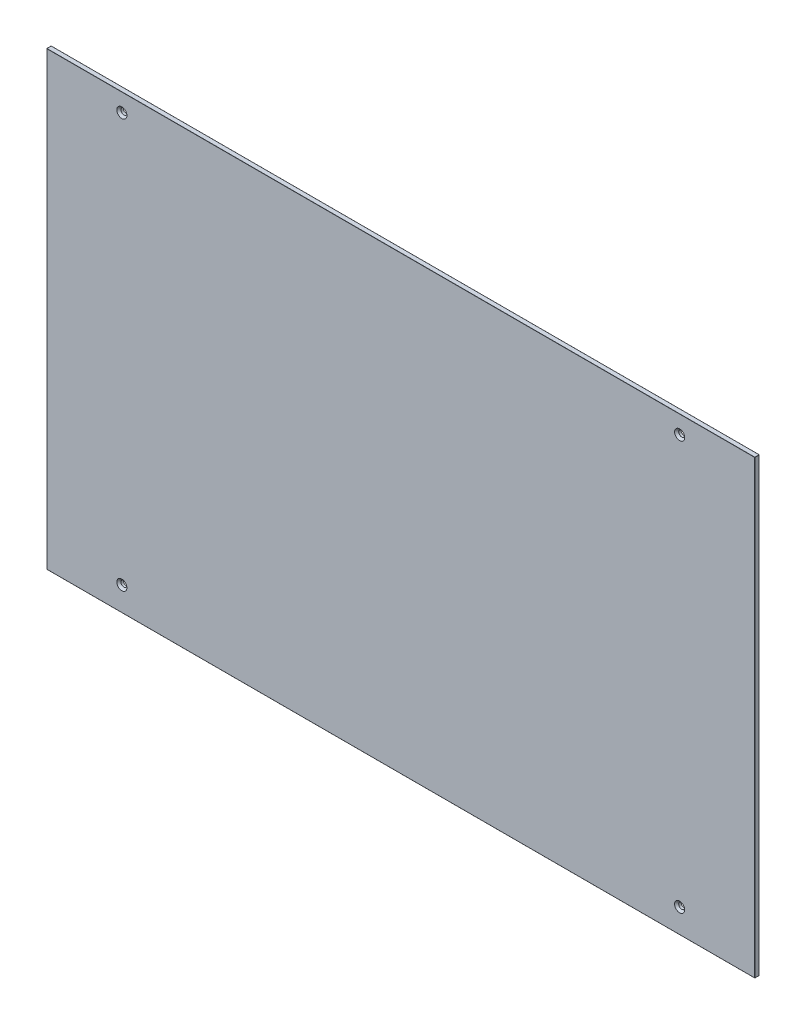
ISO-10303-21;
HEADER;
FILE_DESCRIPTION(('STEP AP214'),'2;1');
FILE_NAME('part.step','',(''),(''),'','','');
FILE_SCHEMA(('AUTOMOTIVE_DESIGN { 1 0 10303 214 1 1 1 1 }'));
ENDSEC;
DATA;
#1=APPLICATION_CONTEXT('core data for automotive mechanical design processes');
#2=APPLICATION_PROTOCOL_DEFINITION('international standard','automotive_design',2000,#1);
#3=PRODUCT_CONTEXT('',#1,'mechanical');
#4=PRODUCT('Part','Part','',(#3));
#5=PRODUCT_RELATED_PRODUCT_CATEGORY('part','',(#4));
#6=PRODUCT_DEFINITION_FORMATION('','',#4);
#7=PRODUCT_DEFINITION_CONTEXT('part definition',#1,'design');
#8=PRODUCT_DEFINITION('design','',#6,#7);
#9=PRODUCT_DEFINITION_SHAPE('','',#8);
#10=(LENGTH_UNIT() NAMED_UNIT(*) SI_UNIT(.MILLI.,.METRE.));
#11=(NAMED_UNIT(*) PLANE_ANGLE_UNIT() SI_UNIT($,.RADIAN.));
#12=(NAMED_UNIT(*) SI_UNIT($,.STERADIAN.) SOLID_ANGLE_UNIT());
#13=UNCERTAINTY_MEASURE_WITH_UNIT(LENGTH_MEASURE(1.E-05),#10,'distance_accuracy_value','');
#14=(GEOMETRIC_REPRESENTATION_CONTEXT(3) GLOBAL_UNCERTAINTY_ASSIGNED_CONTEXT((#13)) GLOBAL_UNIT_ASSIGNED_CONTEXT((#10,
#11,#12)) REPRESENTATION_CONTEXT('',''));
#15=CARTESIAN_POINT('',(0.,0.,0.));
#16=DIRECTION('',(0.,0.,1.));
#17=DIRECTION('',(1.,0.,0.));
#18=AXIS2_PLACEMENT_3D('',#15,#16,#17);
#19=CARTESIAN_POINT('',(471.,-300.,6.));
#20=DIRECTION('',(-1.,0.,0.));
#21=DIRECTION('',(0.,0.,1.));
#22=AXIS2_PLACEMENT_3D('',#19,#20,#21);
#23=PLANE('',#22);
#24=DIRECTION('',(0.,0.,-1.));
#25=VECTOR('',#24,1.);
#26=CARTESIAN_POINT('',(471.,-299.8,6.));
#27=LINE('',#26,#25);
#28=CARTESIAN_POINT('',(471.,-299.8,5.8));
#29=VERTEX_POINT('',#28);
#30=CARTESIAN_POINT('',(471.,-299.8,0.2));
#31=VERTEX_POINT('',#30);
#32=EDGE_CURVE('E180',#29,#31,#27,.T.);
#33=ORIENTED_EDGE('',*,*,#32,.T.);
#34=DIRECTION('',(0.,1.,0.));
#35=VECTOR('',#34,1.);
#36=CARTESIAN_POINT('',(471.,300.,0.2));
#37=LINE('',#36,#35);
#38=CARTESIAN_POINT('',(471.,299.8,0.2));
#39=VERTEX_POINT('',#38);
#40=EDGE_CURVE('E182',#31,#39,#37,.T.);
#41=ORIENTED_EDGE('',*,*,#40,.T.);
#42=DIRECTION('',(0.,0.,-1.));
#43=VECTOR('',#42,1.);
#44=CARTESIAN_POINT('',(471.,299.8,6.));
#45=LINE('',#44,#43);
#46=CARTESIAN_POINT('',(471.,299.8,5.8));
#47=VERTEX_POINT('',#46);
#48=EDGE_CURVE('E176',#39,#47,#45,.F.);
#49=ORIENTED_EDGE('',*,*,#48,.T.);
#50=DIRECTION('',(0.,1.,0.));
#51=VECTOR('',#50,1.);
#52=CARTESIAN_POINT('',(471.,-300.,5.8));
#53=LINE('',#52,#51);
#54=EDGE_CURVE('E178',#47,#29,#53,.F.);
#55=ORIENTED_EDGE('',*,*,#54,.T.);
#56=EDGE_LOOP('',(#33,#41,#49,#55));
#57=FACE_BOUND('',#56,.T.);
#58=ADVANCED_FACE('F32',(#57),#23,.F.);
#59=CARTESIAN_POINT('',(-471.,300.,6.));
#60=DIRECTION('',(0.,-1.,0.));
#61=DIRECTION('',(0.,0.,-1.));
#62=AXIS2_PLACEMENT_3D('',#59,#60,#61);
#63=PLANE('',#62);
#64=DIRECTION('',(-1.,0.,0.));
#65=VECTOR('',#64,1.);
#66=CARTESIAN_POINT('',(-471.,300.,5.8));
#67=LINE('',#66,#65);
#68=CARTESIAN_POINT('',(-470.8,300.,5.8));
#69=VERTEX_POINT('',#68);
#70=CARTESIAN_POINT('',(470.8,300.,5.8));
#71=VERTEX_POINT('',#70);
#72=EDGE_CURVE('E194',#69,#71,#67,.F.);
#73=ORIENTED_EDGE('',*,*,#72,.T.);
#74=DIRECTION('',(0.,0.,-1.));
#75=VECTOR('',#74,1.);
#76=CARTESIAN_POINT('',(470.8,300.,6.));
#77=LINE('',#76,#75);
#78=CARTESIAN_POINT('',(470.8,300.,0.2));
#79=VERTEX_POINT('',#78);
#80=EDGE_CURVE('E198',#71,#79,#77,.T.);
#81=ORIENTED_EDGE('',*,*,#80,.T.);
#82=DIRECTION('',(-1.,0.,0.));
#83=VECTOR('',#82,1.);
#84=CARTESIAN_POINT('',(-471.,300.,0.2));
#85=LINE('',#84,#83);
#86=CARTESIAN_POINT('',(-470.8,300.,0.2));
#87=VERTEX_POINT('',#86);
#88=EDGE_CURVE('E196',#79,#87,#85,.T.);
#89=ORIENTED_EDGE('',*,*,#88,.T.);
#90=DIRECTION('',(0.,0.,-1.));
#91=VECTOR('',#90,1.);
#92=CARTESIAN_POINT('',(-470.8,300.,6.));
#93=LINE('',#92,#91);
#94=EDGE_CURVE('E192',#87,#69,#93,.F.);
#95=ORIENTED_EDGE('',*,*,#94,.T.);
#96=EDGE_LOOP('',(#73,#81,#89,#95));
#97=FACE_BOUND('',#96,.T.);
#98=ADVANCED_FACE('F317',(#97),#63,.F.);
#99=CARTESIAN_POINT('',(-471.,-300.,6.));
#100=DIRECTION('',(1.,0.,0.));
#101=DIRECTION('',(0.,0.,-1.));
#102=AXIS2_PLACEMENT_3D('',#99,#100,#101);
#103=PLANE('',#102);
#104=DIRECTION('',(0.,-1.,0.));
#105=VECTOR('',#104,1.);
#106=CARTESIAN_POINT('',(-471.,-300.,0.2));
#107=LINE('',#106,#105);
#108=CARTESIAN_POINT('',(-471.,299.8,0.2));
#109=VERTEX_POINT('',#108);
#110=CARTESIAN_POINT('',(-471.,-299.8,0.2));
#111=VERTEX_POINT('',#110);
#112=EDGE_CURVE('E41',#109,#111,#107,.T.);
#113=ORIENTED_EDGE('',*,*,#112,.T.);
#114=DIRECTION('',(0.,0.,-1.));
#115=VECTOR('',#114,1.);
#116=CARTESIAN_POINT('',(-471.,-299.8,6.));
#117=LINE('',#116,#115);
#118=CARTESIAN_POINT('',(-471.,-299.8,5.8));
#119=VERTEX_POINT('',#118);
#120=EDGE_CURVE('E11',#111,#119,#117,.F.);
#121=ORIENTED_EDGE('',*,*,#120,.T.);
#122=DIRECTION('',(0.,-1.,0.));
#123=VECTOR('',#122,1.);
#124=CARTESIAN_POINT('',(-471.,-300.,5.8));
#125=LINE('',#124,#123);
#126=CARTESIAN_POINT('',(-471.,299.8,5.8));
#127=VERTEX_POINT('',#126);
#128=EDGE_CURVE('E201',#119,#127,#125,.F.);
#129=ORIENTED_EDGE('',*,*,#128,.T.);
#130=DIRECTION('',(0.,0.,-1.));
#131=VECTOR('',#130,1.);
#132=CARTESIAN_POINT('',(-471.,299.8,6.));
#133=LINE('',#132,#131);
#134=EDGE_CURVE('E52',#127,#109,#133,.T.);
#135=ORIENTED_EDGE('',*,*,#134,.T.);
#136=EDGE_LOOP('',(#113,#121,#129,#135));
#137=FACE_BOUND('',#136,.T.);
#138=ADVANCED_FACE('F323',(#137),#103,.F.);
#139=CARTESIAN_POINT('',(-471.,-300.,6.));
#140=DIRECTION('',(0.,1.,0.));
#141=DIRECTION('',(0.,0.,1.));
#142=AXIS2_PLACEMENT_3D('',#139,#140,#141);
#143=PLANE('',#142);
#144=DIRECTION('',(0.,0.,-1.));
#145=VECTOR('',#144,1.);
#146=CARTESIAN_POINT('',(-470.8,-300.,6.));
#147=LINE('',#146,#145);
#148=CARTESIAN_POINT('',(-470.8,-300.,5.8));
#149=VERTEX_POINT('',#148);
#150=CARTESIAN_POINT('',(-470.8,-300.,0.2));
#151=VERTEX_POINT('',#150);
#152=EDGE_CURVE('E125',#149,#151,#147,.T.);
#153=ORIENTED_EDGE('',*,*,#152,.T.);
#154=DIRECTION('',(1.,0.,0.));
#155=VECTOR('',#154,1.);
#156=CARTESIAN_POINT('',(471.,-300.,0.2));
#157=LINE('',#156,#155);
#158=CARTESIAN_POINT('',(470.8,-300.,0.2));
#159=VERTEX_POINT('',#158);
#160=EDGE_CURVE('E165',#151,#159,#157,.T.);
#161=ORIENTED_EDGE('',*,*,#160,.T.);
#162=DIRECTION('',(0.,0.,-1.));
#163=VECTOR('',#162,1.);
#164=CARTESIAN_POINT('',(470.8,-300.,6.));
#165=LINE('',#164,#163);
#166=CARTESIAN_POINT('',(470.8,-300.,5.8));
#167=VERTEX_POINT('',#166);
#168=EDGE_CURVE('E128',#159,#167,#165,.F.);
#169=ORIENTED_EDGE('',*,*,#168,.T.);
#170=DIRECTION('',(1.,0.,0.));
#171=VECTOR('',#170,1.);
#172=CARTESIAN_POINT('',(-471.,-300.,5.8));
#173=LINE('',#172,#171);
#174=EDGE_CURVE('E120',#167,#149,#173,.F.);
#175=ORIENTED_EDGE('',*,*,#174,.T.);
#176=EDGE_LOOP('',(#153,#161,#169,#175));
#177=FACE_BOUND('',#176,.T.);
#178=ADVANCED_FACE('F122',(#177),#143,.F.);
#179=CARTESIAN_POINT('',(0.,0.,6.));
#180=DIRECTION('',(0.,0.,-1.));
#181=DIRECTION('',(-1.,0.,0.));
#182=AXIS2_PLACEMENT_3D('',#179,#180,#181);
#183=PLANE('',#182);
#184=DIRECTION('',(0.,-1.,0.));
#185=VECTOR('',#184,1.);
#186=CARTESIAN_POINT('',(-470.8,0.,6.));
#187=LINE('',#186,#185);
#188=CARTESIAN_POINT('',(-470.8,299.8,6.));
#189=VERTEX_POINT('',#188);
#190=CARTESIAN_POINT('',(-470.8,-299.8,6.));
#191=VERTEX_POINT('',#190);
#192=EDGE_CURVE('E185',#189,#191,#187,.T.);
#193=ORIENTED_EDGE('',*,*,#192,.T.);
#194=DIRECTION('',(1.,0.,0.));
#195=VECTOR('',#194,1.);
#196=CARTESIAN_POINT('',(0.,-299.8,6.));
#197=LINE('',#196,#195);
#198=CARTESIAN_POINT('',(470.8,-299.8,6.));
#199=VERTEX_POINT('',#198);
#200=EDGE_CURVE('E139',#191,#199,#197,.T.);
#201=ORIENTED_EDGE('',*,*,#200,.T.);
#202=DIRECTION('',(0.,1.,0.));
#203=VECTOR('',#202,1.);
#204=CARTESIAN_POINT('',(470.8,0.,6.));
#205=LINE('',#204,#203);
#206=CARTESIAN_POINT('',(470.8,299.8,6.));
#207=VERTEX_POINT('',#206);
#208=EDGE_CURVE('E189',#199,#207,#205,.T.);
#209=ORIENTED_EDGE('',*,*,#208,.T.);
#210=DIRECTION('',(-1.,0.,0.));
#211=VECTOR('',#210,1.);
#212=CARTESIAN_POINT('',(0.,299.8,6.));
#213=LINE('',#212,#211);
#214=EDGE_CURVE('E187',#207,#189,#213,.T.);
#215=ORIENTED_EDGE('',*,*,#214,.T.);
#216=EDGE_LOOP('',(#193,#201,#209,#215));
#217=FACE_BOUND('',#216,.T.);
#218=CARTESIAN_POINT('',(-371.,-268.,6.));
#219=DIRECTION('',(0.,0.,-1.));
#220=DIRECTION('',(-1.,0.,0.));
#221=AXIS2_PLACEMENT_3D('',#218,#219,#220);
#222=CIRCLE('',#221,6.75000000000014);
#223=CARTESIAN_POINT('',(-377.75,-268.,6.));
#224=VERTEX_POINT('',#223);
#225=EDGE_CURVE('E289',#224,#224,#222,.T.);
#226=ORIENTED_EDGE('',*,*,#225,.T.);
#227=EDGE_LOOP('',(#226));
#228=FACE_BOUND('',#227,.T.);
#229=CARTESIAN_POINT('',(371.,-268.,6.));
#230=DIRECTION('',(0.,0.,-1.));
#231=DIRECTION('',(-1.,0.,0.));
#232=AXIS2_PLACEMENT_3D('',#229,#230,#231);
#233=CIRCLE('',#232,6.75000000000014);
#234=CARTESIAN_POINT('',(364.25,-268.,6.));
#235=VERTEX_POINT('',#234);
#236=EDGE_CURVE('E286',#235,#235,#233,.T.);
#237=ORIENTED_EDGE('',*,*,#236,.T.);
#238=EDGE_LOOP('',(#237));
#239=FACE_BOUND('',#238,.T.);
#240=CARTESIAN_POINT('',(371.,276.,6.));
#241=DIRECTION('',(0.,0.,-1.));
#242=DIRECTION('',(-1.,0.,0.));
#243=AXIS2_PLACEMENT_3D('',#240,#241,#242);
#244=CIRCLE('',#243,6.75000000000014);
#245=CARTESIAN_POINT('',(364.25,276.,6.));
#246=VERTEX_POINT('',#245);
#247=EDGE_CURVE('E283',#246,#246,#244,.T.);
#248=ORIENTED_EDGE('',*,*,#247,.T.);
#249=EDGE_LOOP('',(#248));
#250=FACE_BOUND('',#249,.T.);
#251=CARTESIAN_POINT('',(-371.,276.,6.));
#252=DIRECTION('',(0.,0.,-1.));
#253=DIRECTION('',(-1.,0.,0.));
#254=AXIS2_PLACEMENT_3D('',#251,#252,#253);
#255=CIRCLE('',#254,6.75000000000014);
#256=CARTESIAN_POINT('',(-377.75,276.,6.));
#257=VERTEX_POINT('',#256);
#258=EDGE_CURVE('E280',#257,#257,#255,.T.);
#259=ORIENTED_EDGE('',*,*,#258,.T.);
#260=EDGE_LOOP('',(#259));
#261=FACE_BOUND('',#260,.T.);
#262=ADVANCED_FACE('F342',(#217,#228,#239,#250,#261),#183,.F.);
#263=CARTESIAN_POINT('',(0.,0.,0.));
#264=DIRECTION('',(0.,0.,-1.));
#265=DIRECTION('',(-1.,0.,0.));
#266=AXIS2_PLACEMENT_3D('',#263,#264,#265);
#267=PLANE('',#266);
#268=DIRECTION('',(0.,1.,0.));
#269=VECTOR('',#268,1.);
#270=CARTESIAN_POINT('',(470.8,-300.,0.));
#271=LINE('',#270,#269);
#272=CARTESIAN_POINT('',(470.8,299.8,0.));
#273=VERTEX_POINT('',#272);
#274=CARTESIAN_POINT('',(470.8,-299.8,0.));
#275=VERTEX_POINT('',#274);
#276=EDGE_CURVE('E171',#273,#275,#271,.F.);
#277=ORIENTED_EDGE('',*,*,#276,.T.);
#278=DIRECTION('',(1.,0.,0.));
#279=VECTOR('',#278,1.);
#280=CARTESIAN_POINT('',(-471.,-299.8,0.));
#281=LINE('',#280,#279);
#282=CARTESIAN_POINT('',(-470.8,-299.8,0.));
#283=VERTEX_POINT('',#282);
#284=EDGE_CURVE('E173',#275,#283,#281,.F.);
#285=ORIENTED_EDGE('',*,*,#284,.T.);
#286=DIRECTION('',(0.,-1.,0.));
#287=VECTOR('',#286,1.);
#288=CARTESIAN_POINT('',(-470.8,300.,0.));
#289=LINE('',#288,#287);
#290=CARTESIAN_POINT('',(-470.8,299.8,0.));
#291=VERTEX_POINT('',#290);
#292=EDGE_CURVE('E167',#283,#291,#289,.F.);
#293=ORIENTED_EDGE('',*,*,#292,.T.);
#294=DIRECTION('',(-1.,0.,0.));
#295=VECTOR('',#294,1.);
#296=CARTESIAN_POINT('',(471.,299.8,0.));
#297=LINE('',#296,#295);
#298=EDGE_CURVE('E169',#291,#273,#297,.F.);
#299=ORIENTED_EDGE('',*,*,#298,.T.);
#300=EDGE_LOOP('',(#277,#285,#293,#299));
#301=FACE_BOUND('',#300,.T.);
#302=CARTESIAN_POINT('',(-371.,-268.,0.));
#303=DIRECTION('',(0.,0.,1.));
#304=DIRECTION('',(1.,0.,0.));
#305=AXIS2_PLACEMENT_3D('',#302,#303,#304);
#306=CIRCLE('',#305,3.99999999999999);
#307=CARTESIAN_POINT('',(-367.,-268.,0.));
#308=VERTEX_POINT('',#307);
#309=EDGE_CURVE('E258',#308,#308,#306,.T.);
#310=ORIENTED_EDGE('',*,*,#309,.T.);
#311=EDGE_LOOP('',(#310));
#312=FACE_BOUND('',#311,.T.);
#313=CARTESIAN_POINT('',(371.,-268.,0.));
#314=DIRECTION('',(0.,0.,1.));
#315=DIRECTION('',(1.,0.,0.));
#316=AXIS2_PLACEMENT_3D('',#313,#314,#315);
#317=CIRCLE('',#316,3.99999999999999);
#318=CARTESIAN_POINT('',(375.,-268.,0.));
#319=VERTEX_POINT('',#318);
#320=EDGE_CURVE('E264',#319,#319,#317,.T.);
#321=ORIENTED_EDGE('',*,*,#320,.T.);
#322=EDGE_LOOP('',(#321));
#323=FACE_BOUND('',#322,.T.);
#324=CARTESIAN_POINT('',(371.,276.,0.));
#325=DIRECTION('',(0.,0.,1.));
#326=DIRECTION('',(1.,0.,0.));
#327=AXIS2_PLACEMENT_3D('',#324,#325,#326);
#328=CIRCLE('',#327,3.99999999999999);
#329=CARTESIAN_POINT('',(375.,276.,0.));
#330=VERTEX_POINT('',#329);
#331=EDGE_CURVE('E269',#330,#330,#328,.T.);
#332=ORIENTED_EDGE('',*,*,#331,.T.);
#333=EDGE_LOOP('',(#332));
#334=FACE_BOUND('',#333,.T.);
#335=CARTESIAN_POINT('',(-371.,276.,0.));
#336=DIRECTION('',(0.,0.,1.));
#337=DIRECTION('',(1.,0.,0.));
#338=AXIS2_PLACEMENT_3D('',#335,#336,#337);
#339=CIRCLE('',#338,3.99999999999999);
#340=CARTESIAN_POINT('',(-367.,276.,0.));
#341=VERTEX_POINT('',#340);
#342=EDGE_CURVE('E274',#341,#341,#339,.T.);
#343=ORIENTED_EDGE('',*,*,#342,.T.);
#344=EDGE_LOOP('',(#343));
#345=FACE_BOUND('',#344,.T.);
#346=ADVANCED_FACE('F345',(#301,#312,#323,#334,#345),#267,.T.);
#347=CARTESIAN_POINT('',(-371.,276.,0.));
#348=DIRECTION('',(0.,0.,1.));
#349=DIRECTION('',(1.,0.,0.));
#350=AXIS2_PLACEMENT_3D('',#347,#348,#349);
#351=CYLINDRICAL_SURFACE('',#350,3.99999999999999);
#352=CARTESIAN_POINT('',(-371.,276.,3.24999999999983));
#353=DIRECTION('',(0.,0.,-1.));
#354=DIRECTION('',(-1.,0.,0.));
#355=AXIS2_PLACEMENT_3D('',#352,#353,#354);
#356=CIRCLE('',#355,3.99999999999999);
#357=CARTESIAN_POINT('',(-375.,276.,3.24999999999983));
#358=VERTEX_POINT('',#357);
#359=EDGE_CURVE('E157',#358,#358,#356,.F.);
#360=ORIENTED_EDGE('',*,*,#359,.T.);
#361=EDGE_LOOP('',(#360));
#362=FACE_BOUND('',#361,.T.);
#363=ORIENTED_EDGE('',*,*,#342,.F.);
#364=EDGE_LOOP('',(#363));
#365=FACE_BOUND('',#364,.T.);
#366=ADVANCED_FACE('F355',(#362,#365),#351,.F.);
#367=CARTESIAN_POINT('',(371.,276.,0.));
#368=DIRECTION('',(0.,0.,1.));
#369=DIRECTION('',(1.,0.,0.));
#370=AXIS2_PLACEMENT_3D('',#367,#368,#369);
#371=CYLINDRICAL_SURFACE('',#370,3.99999999999999);
#372=CARTESIAN_POINT('',(371.,276.,3.24999999999983));
#373=DIRECTION('',(0.,0.,-1.));
#374=DIRECTION('',(-1.,0.,0.));
#375=AXIS2_PLACEMENT_3D('',#372,#373,#374);
#376=CIRCLE('',#375,3.99999999999999);
#377=CARTESIAN_POINT('',(367.,276.,3.24999999999983));
#378=VERTEX_POINT('',#377);
#379=EDGE_CURVE('E160',#378,#378,#376,.F.);
#380=ORIENTED_EDGE('',*,*,#379,.T.);
#381=EDGE_LOOP('',(#380));
#382=FACE_BOUND('',#381,.T.);
#383=ORIENTED_EDGE('',*,*,#331,.F.);
#384=EDGE_LOOP('',(#383));
#385=FACE_BOUND('',#384,.T.);
#386=ADVANCED_FACE('F297',(#382,#385),#371,.F.);
#387=CARTESIAN_POINT('',(371.,-268.,0.));
#388=DIRECTION('',(0.,0.,1.));
#389=DIRECTION('',(1.,0.,0.));
#390=AXIS2_PLACEMENT_3D('',#387,#388,#389);
#391=CYLINDRICAL_SURFACE('',#390,3.99999999999999);
#392=CARTESIAN_POINT('',(371.,-268.,3.24999999999983));
#393=DIRECTION('',(0.,0.,-1.));
#394=DIRECTION('',(-1.,0.,0.));
#395=AXIS2_PLACEMENT_3D('',#392,#393,#394);
#396=CIRCLE('',#395,3.99999999999999);
#397=CARTESIAN_POINT('',(367.,-268.,3.24999999999983));
#398=VERTEX_POINT('',#397);
#399=EDGE_CURVE('E292',#398,#398,#396,.F.);
#400=ORIENTED_EDGE('',*,*,#399,.T.);
#401=EDGE_LOOP('',(#400));
#402=FACE_BOUND('',#401,.T.);
#403=ORIENTED_EDGE('',*,*,#320,.F.);
#404=EDGE_LOOP('',(#403));
#405=FACE_BOUND('',#404,.T.);
#406=ADVANCED_FACE('F334',(#402,#405),#391,.F.);
#407=CARTESIAN_POINT('',(-371.,-268.,0.));
#408=DIRECTION('',(0.,0.,1.));
#409=DIRECTION('',(1.,0.,0.));
#410=AXIS2_PLACEMENT_3D('',#407,#408,#409);
#411=CYLINDRICAL_SURFACE('',#410,3.99999999999999);
#412=CARTESIAN_POINT('',(-371.,-268.,3.24999999999983));
#413=DIRECTION('',(0.,0.,-1.));
#414=DIRECTION('',(-1.,0.,0.));
#415=AXIS2_PLACEMENT_3D('',#412,#413,#414);
#416=CIRCLE('',#415,3.99999999999999);
#417=CARTESIAN_POINT('',(-375.,-268.,3.24999999999983));
#418=VERTEX_POINT('',#417);
#419=EDGE_CURVE('E277',#418,#418,#416,.F.);
#420=ORIENTED_EDGE('',*,*,#419,.T.);
#421=EDGE_LOOP('',(#420));
#422=FACE_BOUND('',#421,.T.);
#423=ORIENTED_EDGE('',*,*,#309,.F.);
#424=EDGE_LOOP('',(#423));
#425=FACE_BOUND('',#424,.T.);
#426=ADVANCED_FACE('F329',(#422,#425),#411,.F.);
#427=CARTESIAN_POINT('',(-371.,-268.,3.24999999999983));
#428=DIRECTION('',(0.,0.,1.));
#429=DIRECTION('',(1.,0.,0.));
#430=AXIS2_PLACEMENT_3D('',#427,#428,#429);
#431=CONICAL_SURFACE('',#430,3.99999999999999,0.785398163397446);
#432=ORIENTED_EDGE('',*,*,#225,.F.);
#433=EDGE_LOOP('',(#432));
#434=FACE_BOUND('',#433,.T.);
#435=ORIENTED_EDGE('',*,*,#419,.F.);
#436=EDGE_LOOP('',(#435));
#437=FACE_BOUND('',#436,.T.);
#438=ADVANCED_FACE('F312',(#434,#437),#431,.F.);
#439=CARTESIAN_POINT('',(371.,-268.,3.24999999999983));
#440=DIRECTION('',(0.,0.,1.));
#441=DIRECTION('',(1.,0.,0.));
#442=AXIS2_PLACEMENT_3D('',#439,#440,#441);
#443=CONICAL_SURFACE('',#442,3.99999999999999,0.785398163397446);
#444=ORIENTED_EDGE('',*,*,#236,.F.);
#445=EDGE_LOOP('',(#444));
#446=FACE_BOUND('',#445,.T.);
#447=ORIENTED_EDGE('',*,*,#399,.F.);
#448=EDGE_LOOP('',(#447));
#449=FACE_BOUND('',#448,.T.);
#450=ADVANCED_FACE('F303',(#446,#449),#443,.F.);
#451=CARTESIAN_POINT('',(371.,276.,3.24999999999983));
#452=DIRECTION('',(0.,0.,1.));
#453=DIRECTION('',(1.,0.,0.));
#454=AXIS2_PLACEMENT_3D('',#451,#452,#453);
#455=CONICAL_SURFACE('',#454,3.99999999999999,0.785398163397446);
#456=ORIENTED_EDGE('',*,*,#247,.F.);
#457=EDGE_LOOP('',(#456));
#458=FACE_BOUND('',#457,.T.);
#459=ORIENTED_EDGE('',*,*,#379,.F.);
#460=EDGE_LOOP('',(#459));
#461=FACE_BOUND('',#460,.T.);
#462=ADVANCED_FACE('F300',(#458,#461),#455,.F.);
#463=CARTESIAN_POINT('',(-371.,276.,3.24999999999983));
#464=DIRECTION('',(0.,0.,1.));
#465=DIRECTION('',(1.,0.,0.));
#466=AXIS2_PLACEMENT_3D('',#463,#464,#465);
#467=CONICAL_SURFACE('',#466,3.99999999999999,0.785398163397446);
#468=ORIENTED_EDGE('',*,*,#258,.F.);
#469=EDGE_LOOP('',(#468));
#470=FACE_BOUND('',#469,.T.);
#471=ORIENTED_EDGE('',*,*,#359,.F.);
#472=EDGE_LOOP('',(#471));
#473=FACE_BOUND('',#472,.T.);
#474=ADVANCED_FACE('F302',(#470,#473),#467,.F.);
#475=CARTESIAN_POINT('',(0.,299.8,5.8));
#476=DIRECTION('',(-1.,0.,0.));
#477=DIRECTION('',(0.,0.,1.));
#478=AXIS2_PLACEMENT_3D('',#475,#476,#477);
#479=CYLINDRICAL_SURFACE('',#478,0.2);
#480=CARTESIAN_POINT('',(-470.8,299.8,5.8));
#481=DIRECTION('',(-1.,0.,0.));
#482=DIRECTION('',(0.,0.,1.));
#483=AXIS2_PLACEMENT_3D('',#480,#481,#482);
#484=CIRCLE('',#483,0.2);
#485=EDGE_CURVE('E36',#189,#69,#484,.T.);
#486=ORIENTED_EDGE('',*,*,#485,.F.);
#487=ORIENTED_EDGE('',*,*,#214,.F.);
#488=CARTESIAN_POINT('',(470.8,299.8,5.8));
#489=DIRECTION('',(1.,0.,0.));
#490=DIRECTION('',(0.,0.,-1.));
#491=AXIS2_PLACEMENT_3D('',#488,#489,#490);
#492=CIRCLE('',#491,0.2);
#493=EDGE_CURVE('E251',#71,#207,#492,.T.);
#494=ORIENTED_EDGE('',*,*,#493,.F.);
#495=ORIENTED_EDGE('',*,*,#72,.F.);
#496=EDGE_LOOP('',(#486,#487,#494,#495));
#497=FACE_BOUND('',#496,.T.);
#498=ADVANCED_FACE('F34',(#497),#479,.T.);
#499=CARTESIAN_POINT('',(-470.8,299.8,5.8));
#500=DIRECTION('',(0.,0.,1.));
#501=DIRECTION('',(1.,0.,0.));
#502=AXIS2_PLACEMENT_3D('',#499,#500,#501);
#503=SPHERICAL_SURFACE('',#502,0.2);
#504=CARTESIAN_POINT('',(-470.8,299.8,5.8));
#505=DIRECTION('',(0.,1.,0.));
#506=DIRECTION('',(0.,0.,1.));
#507=AXIS2_PLACEMENT_3D('',#504,#505,#506);
#508=CIRCLE('',#507,0.2);
#509=EDGE_CURVE('E246',#189,#127,#508,.F.);
#510=ORIENTED_EDGE('',*,*,#509,.F.);
#511=ORIENTED_EDGE('',*,*,#485,.T.);
#512=CARTESIAN_POINT('',(-470.8,299.8,5.8));
#513=DIRECTION('',(0.,0.,1.));
#514=DIRECTION('',(1.,0.,0.));
#515=AXIS2_PLACEMENT_3D('',#512,#513,#514);
#516=CIRCLE('',#515,0.2);
#517=EDGE_CURVE('E249',#127,#69,#516,.F.);
#518=ORIENTED_EDGE('',*,*,#517,.F.);
#519=EDGE_LOOP('',(#510,#511,#518));
#520=FACE_BOUND('',#519,.T.);
#521=ADVANCED_FACE('F395',(#520),#503,.T.);
#522=CARTESIAN_POINT('',(470.8,299.8,5.8));
#523=DIRECTION('',(0.,0.,1.));
#524=DIRECTION('',(1.,0.,0.));
#525=AXIS2_PLACEMENT_3D('',#522,#523,#524);
#526=SPHERICAL_SURFACE('',#525,0.2);
#527=CARTESIAN_POINT('',(470.8,299.8,5.8));
#528=DIRECTION('',(0.,0.,1.));
#529=DIRECTION('',(1.,0.,0.));
#530=AXIS2_PLACEMENT_3D('',#527,#528,#529);
#531=CIRCLE('',#530,0.2);
#532=EDGE_CURVE('E240',#71,#47,#531,.F.);
#533=ORIENTED_EDGE('',*,*,#532,.F.);
#534=ORIENTED_EDGE('',*,*,#493,.T.);
#535=CARTESIAN_POINT('',(470.8,299.8,5.8));
#536=DIRECTION('',(0.,1.,0.));
#537=DIRECTION('',(0.,0.,1.));
#538=AXIS2_PLACEMENT_3D('',#535,#536,#537);
#539=CIRCLE('',#538,0.2);
#540=EDGE_CURVE('E243',#47,#207,#539,.F.);
#541=ORIENTED_EDGE('',*,*,#540,.F.);
#542=EDGE_LOOP('',(#533,#534,#541));
#543=FACE_BOUND('',#542,.T.);
#544=ADVANCED_FACE('F405',(#543),#526,.T.);
#545=CARTESIAN_POINT('',(-470.8,299.8,6.));
#546=DIRECTION('',(0.,0.,-1.));
#547=DIRECTION('',(-1.,0.,0.));
#548=AXIS2_PLACEMENT_3D('',#545,#546,#547);
#549=CYLINDRICAL_SURFACE('',#548,0.2);
#550=ORIENTED_EDGE('',*,*,#517,.T.);
#551=ORIENTED_EDGE('',*,*,#94,.F.);
#552=CARTESIAN_POINT('',(-470.8,299.8,0.2));
#553=DIRECTION('',(0.,0.,-1.));
#554=DIRECTION('',(-1.,0.,0.));
#555=AXIS2_PLACEMENT_3D('',#552,#553,#554);
#556=CIRCLE('',#555,0.2);
#557=EDGE_CURVE('E234',#109,#87,#556,.T.);
#558=ORIENTED_EDGE('',*,*,#557,.F.);
#559=ORIENTED_EDGE('',*,*,#134,.F.);
#560=EDGE_LOOP('',(#550,#551,#558,#559));
#561=FACE_BOUND('',#560,.T.);
#562=ADVANCED_FACE('F413',(#561),#549,.T.);
#563=CARTESIAN_POINT('',(-470.8,0.,5.8));
#564=DIRECTION('',(0.,-1.,0.));
#565=DIRECTION('',(0.,0.,-1.));
#566=AXIS2_PLACEMENT_3D('',#563,#564,#565);
#567=CYLINDRICAL_SURFACE('',#566,0.2);
#568=ORIENTED_EDGE('',*,*,#509,.T.);
#569=ORIENTED_EDGE('',*,*,#128,.F.);
#570=CARTESIAN_POINT('',(-470.8,-299.8,5.8));
#571=DIRECTION('',(0.,-1.,0.));
#572=DIRECTION('',(0.,0.,-1.));
#573=AXIS2_PLACEMENT_3D('',#570,#571,#572);
#574=CIRCLE('',#573,0.2);
#575=EDGE_CURVE('E143',#191,#119,#574,.T.);
#576=ORIENTED_EDGE('',*,*,#575,.F.);
#577=ORIENTED_EDGE('',*,*,#192,.F.);
#578=EDGE_LOOP('',(#568,#569,#576,#577));
#579=FACE_BOUND('',#578,.T.);
#580=ADVANCED_FACE('F422',(#579),#567,.T.);
#581=CARTESIAN_POINT('',(0.,-299.8,5.8));
#582=DIRECTION('',(1.,0.,0.));
#583=DIRECTION('',(0.,0.,-1.));
#584=AXIS2_PLACEMENT_3D('',#581,#582,#583);
#585=CYLINDRICAL_SURFACE('',#584,0.2);
#586=CARTESIAN_POINT('',(470.8,-299.8,5.8));
#587=DIRECTION('',(1.,0.,0.));
#588=DIRECTION('',(0.,0.,-1.));
#589=AXIS2_PLACEMENT_3D('',#586,#587,#588);
#590=CIRCLE('',#589,0.2);
#591=EDGE_CURVE('E144',#199,#167,#590,.T.);
#592=ORIENTED_EDGE('',*,*,#591,.F.);
#593=ORIENTED_EDGE('',*,*,#200,.F.);
#594=CARTESIAN_POINT('',(-470.8,-299.8,5.8));
#595=DIRECTION('',(-1.,0.,0.));
#596=DIRECTION('',(0.,0.,1.));
#597=AXIS2_PLACEMENT_3D('',#594,#595,#596);
#598=CIRCLE('',#597,0.2);
#599=EDGE_CURVE('E135',#149,#191,#598,.T.);
#600=ORIENTED_EDGE('',*,*,#599,.F.);
#601=ORIENTED_EDGE('',*,*,#174,.F.);
#602=EDGE_LOOP('',(#592,#593,#600,#601));
#603=FACE_BOUND('',#602,.T.);
#604=ADVANCED_FACE('F137',(#603),#585,.T.);
#605=CARTESIAN_POINT('',(470.8,0.,5.8));
#606=DIRECTION('',(0.,1.,0.));
#607=DIRECTION('',(0.,0.,1.));
#608=AXIS2_PLACEMENT_3D('',#605,#606,#607);
#609=CYLINDRICAL_SURFACE('',#608,0.2);
#610=ORIENTED_EDGE('',*,*,#540,.T.);
#611=ORIENTED_EDGE('',*,*,#208,.F.);
#612=CARTESIAN_POINT('',(470.8,-299.8,5.8));
#613=DIRECTION('',(0.,-1.,0.));
#614=DIRECTION('',(0.,0.,-1.));
#615=AXIS2_PLACEMENT_3D('',#612,#613,#614);
#616=CIRCLE('',#615,0.2);
#617=EDGE_CURVE('E230',#29,#199,#616,.T.);
#618=ORIENTED_EDGE('',*,*,#617,.F.);
#619=ORIENTED_EDGE('',*,*,#54,.F.);
#620=EDGE_LOOP('',(#610,#611,#618,#619));
#621=FACE_BOUND('',#620,.T.);
#622=ADVANCED_FACE('F441',(#621),#609,.T.);
#623=CARTESIAN_POINT('',(470.8,299.8,6.));
#624=DIRECTION('',(0.,0.,-1.));
#625=DIRECTION('',(-1.,0.,0.));
#626=AXIS2_PLACEMENT_3D('',#623,#624,#625);
#627=CYLINDRICAL_SURFACE('',#626,0.2);
#628=ORIENTED_EDGE('',*,*,#532,.T.);
#629=ORIENTED_EDGE('',*,*,#48,.F.);
#630=CARTESIAN_POINT('',(470.8,299.8,0.2));
#631=DIRECTION('',(0.,0.,-1.));
#632=DIRECTION('',(-1.,0.,0.));
#633=AXIS2_PLACEMENT_3D('',#630,#631,#632);
#634=CIRCLE('',#633,0.2);
#635=EDGE_CURVE('E227',#79,#39,#634,.T.);
#636=ORIENTED_EDGE('',*,*,#635,.F.);
#637=ORIENTED_EDGE('',*,*,#80,.F.);
#638=EDGE_LOOP('',(#628,#629,#636,#637));
#639=FACE_BOUND('',#638,.T.);
#640=ADVANCED_FACE('F450',(#639),#627,.T.);
#641=CARTESIAN_POINT('',(-471.,299.8,0.2));
#642=DIRECTION('',(1.,0.,0.));
#643=DIRECTION('',(0.,0.,-1.));
#644=AXIS2_PLACEMENT_3D('',#641,#642,#643);
#645=CYLINDRICAL_SURFACE('',#644,0.2);
#646=CARTESIAN_POINT('',(-470.8,299.8,0.2));
#647=DIRECTION('',(-1.,0.,0.));
#648=DIRECTION('',(0.,0.,1.));
#649=AXIS2_PLACEMENT_3D('',#646,#647,#648);
#650=CIRCLE('',#649,0.2);
#651=EDGE_CURVE('E237',#87,#291,#650,.T.);
#652=ORIENTED_EDGE('',*,*,#651,.F.);
#653=ORIENTED_EDGE('',*,*,#88,.F.);
#654=CARTESIAN_POINT('',(470.8,299.8,0.2));
#655=DIRECTION('',(1.,0.,0.));
#656=DIRECTION('',(0.,0.,-1.));
#657=AXIS2_PLACEMENT_3D('',#654,#655,#656);
#658=CIRCLE('',#657,0.2);
#659=EDGE_CURVE('E225',#273,#79,#658,.T.);
#660=ORIENTED_EDGE('',*,*,#659,.F.);
#661=ORIENTED_EDGE('',*,*,#298,.F.);
#662=EDGE_LOOP('',(#652,#653,#660,#661));
#663=FACE_BOUND('',#662,.T.);
#664=ADVANCED_FACE('F460',(#663),#645,.T.);
#665=CARTESIAN_POINT('',(-470.8,299.8,0.2));
#666=DIRECTION('',(0.,0.,1.));
#667=DIRECTION('',(1.,0.,0.));
#668=AXIS2_PLACEMENT_3D('',#665,#666,#667);
#669=SPHERICAL_SURFACE('',#668,0.2);
#670=ORIENTED_EDGE('',*,*,#557,.T.);
#671=ORIENTED_EDGE('',*,*,#651,.T.);
#672=CARTESIAN_POINT('',(-470.8,299.8,0.2));
#673=DIRECTION('',(0.,1.,0.));
#674=DIRECTION('',(0.,0.,1.));
#675=AXIS2_PLACEMENT_3D('',#672,#673,#674);
#676=CIRCLE('',#675,0.2);
#677=EDGE_CURVE('E150',#109,#291,#676,.F.);
#678=ORIENTED_EDGE('',*,*,#677,.F.);
#679=EDGE_LOOP('',(#670,#671,#678));
#680=FACE_BOUND('',#679,.T.);
#681=ADVANCED_FACE('F470',(#680),#669,.T.);
#682=CARTESIAN_POINT('',(-470.8,-299.8,5.8));
#683=DIRECTION('',(0.,0.,1.));
#684=DIRECTION('',(1.,0.,0.));
#685=AXIS2_PLACEMENT_3D('',#682,#683,#684);
#686=SPHERICAL_SURFACE('',#685,0.2);
#687=ORIENTED_EDGE('',*,*,#599,.T.);
#688=ORIENTED_EDGE('',*,*,#575,.T.);
#689=CARTESIAN_POINT('',(-470.8,-299.8,5.8));
#690=DIRECTION('',(0.,0.,1.));
#691=DIRECTION('',(1.,0.,0.));
#692=AXIS2_PLACEMENT_3D('',#689,#690,#691);
#693=CIRCLE('',#692,0.2);
#694=EDGE_CURVE('E146',#149,#119,#693,.F.);
#695=ORIENTED_EDGE('',*,*,#694,.F.);
#696=EDGE_LOOP('',(#687,#688,#695));
#697=FACE_BOUND('',#696,.T.);
#698=ADVANCED_FACE('F147',(#697),#686,.T.);
#699=CARTESIAN_POINT('',(470.8,-299.8,5.8));
#700=DIRECTION('',(0.,0.,1.));
#701=DIRECTION('',(1.,0.,0.));
#702=AXIS2_PLACEMENT_3D('',#699,#700,#701);
#703=SPHERICAL_SURFACE('',#702,0.2);
#704=ORIENTED_EDGE('',*,*,#617,.T.);
#705=ORIENTED_EDGE('',*,*,#591,.T.);
#706=CARTESIAN_POINT('',(470.8,-299.8,5.8));
#707=DIRECTION('',(0.,0.,1.));
#708=DIRECTION('',(1.,0.,0.));
#709=AXIS2_PLACEMENT_3D('',#706,#707,#708);
#710=CIRCLE('',#709,0.2);
#711=EDGE_CURVE('E151',#29,#167,#710,.F.);
#712=ORIENTED_EDGE('',*,*,#711,.F.);
#713=EDGE_LOOP('',(#704,#705,#712));
#714=FACE_BOUND('',#713,.T.);
#715=ADVANCED_FACE('F489',(#714),#703,.T.);
#716=CARTESIAN_POINT('',(470.8,299.8,0.2));
#717=DIRECTION('',(0.,0.,1.));
#718=DIRECTION('',(1.,0.,0.));
#719=AXIS2_PLACEMENT_3D('',#716,#717,#718);
#720=SPHERICAL_SURFACE('',#719,0.2);
#721=ORIENTED_EDGE('',*,*,#659,.T.);
#722=ORIENTED_EDGE('',*,*,#635,.T.);
#723=CARTESIAN_POINT('',(470.8,299.8,0.2));
#724=DIRECTION('',(0.,1.,0.));
#725=DIRECTION('',(0.,0.,1.));
#726=AXIS2_PLACEMENT_3D('',#723,#724,#725);
#727=CIRCLE('',#726,0.2);
#728=EDGE_CURVE('E219',#273,#39,#727,.F.);
#729=ORIENTED_EDGE('',*,*,#728,.F.);
#730=EDGE_LOOP('',(#721,#722,#729));
#731=FACE_BOUND('',#730,.T.);
#732=ADVANCED_FACE('F498',(#731),#720,.T.);
#733=CARTESIAN_POINT('',(-470.8,-300.,0.2));
#734=DIRECTION('',(0.,1.,0.));
#735=DIRECTION('',(0.,0.,1.));
#736=AXIS2_PLACEMENT_3D('',#733,#734,#735);
#737=CYLINDRICAL_SURFACE('',#736,0.2);
#738=ORIENTED_EDGE('',*,*,#677,.T.);
#739=ORIENTED_EDGE('',*,*,#292,.F.);
#740=CARTESIAN_POINT('',(-470.8,-299.8,0.2));
#741=DIRECTION('',(0.,-1.,0.));
#742=DIRECTION('',(0.,0.,-1.));
#743=AXIS2_PLACEMENT_3D('',#740,#741,#742);
#744=CIRCLE('',#743,0.2);
#745=EDGE_CURVE('E216',#111,#283,#744,.T.);
#746=ORIENTED_EDGE('',*,*,#745,.F.);
#747=ORIENTED_EDGE('',*,*,#112,.F.);
#748=EDGE_LOOP('',(#738,#739,#746,#747));
#749=FACE_BOUND('',#748,.T.);
#750=ADVANCED_FACE('F508',(#749),#737,.T.);
#751=CARTESIAN_POINT('',(-470.8,-299.8,6.));
#752=DIRECTION('',(0.,0.,-1.));
#753=DIRECTION('',(-1.,0.,0.));
#754=AXIS2_PLACEMENT_3D('',#751,#752,#753);
#755=CYLINDRICAL_SURFACE('',#754,0.2);
#756=ORIENTED_EDGE('',*,*,#694,.T.);
#757=ORIENTED_EDGE('',*,*,#120,.F.);
#758=CARTESIAN_POINT('',(-470.8,-299.8,0.2));
#759=DIRECTION('',(0.,0.,-1.));
#760=DIRECTION('',(-1.,0.,0.));
#761=AXIS2_PLACEMENT_3D('',#758,#759,#760);
#762=CIRCLE('',#761,0.2);
#763=EDGE_CURVE('E155',#151,#111,#762,.T.);
#764=ORIENTED_EDGE('',*,*,#763,.F.);
#765=ORIENTED_EDGE('',*,*,#152,.F.);
#766=EDGE_LOOP('',(#756,#757,#764,#765));
#767=FACE_BOUND('',#766,.T.);
#768=ADVANCED_FACE('F153',(#767),#755,.T.);
#769=CARTESIAN_POINT('',(470.8,-299.8,6.));
#770=DIRECTION('',(0.,0.,-1.));
#771=DIRECTION('',(-1.,0.,0.));
#772=AXIS2_PLACEMENT_3D('',#769,#770,#771);
#773=CYLINDRICAL_SURFACE('',#772,0.2);
#774=ORIENTED_EDGE('',*,*,#711,.T.);
#775=ORIENTED_EDGE('',*,*,#168,.F.);
#776=CARTESIAN_POINT('',(470.8,-299.8,0.2));
#777=DIRECTION('',(0.,0.,-1.));
#778=DIRECTION('',(-1.,0.,0.));
#779=AXIS2_PLACEMENT_3D('',#776,#777,#778);
#780=CIRCLE('',#779,0.2);
#781=EDGE_CURVE('E212',#31,#159,#780,.T.);
#782=ORIENTED_EDGE('',*,*,#781,.F.);
#783=ORIENTED_EDGE('',*,*,#32,.F.);
#784=EDGE_LOOP('',(#774,#775,#782,#783));
#785=FACE_BOUND('',#784,.T.);
#786=ADVANCED_FACE('F527',(#785),#773,.T.);
#787=CARTESIAN_POINT('',(470.8,-300.,0.2));
#788=DIRECTION('',(0.,-1.,0.));
#789=DIRECTION('',(0.,0.,-1.));
#790=AXIS2_PLACEMENT_3D('',#787,#788,#789);
#791=CYLINDRICAL_SURFACE('',#790,0.2);
#792=ORIENTED_EDGE('',*,*,#728,.T.);
#793=ORIENTED_EDGE('',*,*,#40,.F.);
#794=CARTESIAN_POINT('',(470.8,-299.8,0.2));
#795=DIRECTION('',(0.,-1.,0.));
#796=DIRECTION('',(0.,0.,-1.));
#797=AXIS2_PLACEMENT_3D('',#794,#795,#796);
#798=CIRCLE('',#797,0.2);
#799=EDGE_CURVE('E209',#275,#31,#798,.T.);
#800=ORIENTED_EDGE('',*,*,#799,.F.);
#801=ORIENTED_EDGE('',*,*,#276,.F.);
#802=EDGE_LOOP('',(#792,#793,#800,#801));
#803=FACE_BOUND('',#802,.T.);
#804=ADVANCED_FACE('F536',(#803),#791,.T.);
#805=CARTESIAN_POINT('',(-470.8,-299.8,0.2));
#806=DIRECTION('',(0.,0.,1.));
#807=DIRECTION('',(1.,0.,0.));
#808=AXIS2_PLACEMENT_3D('',#805,#806,#807);
#809=SPHERICAL_SURFACE('',#808,0.2);
#810=ORIENTED_EDGE('',*,*,#763,.T.);
#811=ORIENTED_EDGE('',*,*,#745,.T.);
#812=CARTESIAN_POINT('',(-470.8,-299.8,0.2));
#813=DIRECTION('',(-1.,0.,0.));
#814=DIRECTION('',(0.,0.,1.));
#815=AXIS2_PLACEMENT_3D('',#812,#813,#814);
#816=CIRCLE('',#815,0.2);
#817=EDGE_CURVE('E207',#151,#283,#816,.F.);
#818=ORIENTED_EDGE('',*,*,#817,.F.);
#819=EDGE_LOOP('',(#810,#811,#818));
#820=FACE_BOUND('',#819,.T.);
#821=ADVANCED_FACE('F546',(#820),#809,.T.);
#822=CARTESIAN_POINT('',(470.8,-299.8,0.2));
#823=DIRECTION('',(0.,0.,1.));
#824=DIRECTION('',(1.,0.,0.));
#825=AXIS2_PLACEMENT_3D('',#822,#823,#824);
#826=SPHERICAL_SURFACE('',#825,0.2);
#827=ORIENTED_EDGE('',*,*,#799,.T.);
#828=ORIENTED_EDGE('',*,*,#781,.T.);
#829=CARTESIAN_POINT('',(470.8,-299.8,0.2));
#830=DIRECTION('',(1.,0.,0.));
#831=DIRECTION('',(0.,0.,-1.));
#832=AXIS2_PLACEMENT_3D('',#829,#830,#831);
#833=CIRCLE('',#832,0.2);
#834=EDGE_CURVE('E205',#275,#159,#833,.F.);
#835=ORIENTED_EDGE('',*,*,#834,.F.);
#836=EDGE_LOOP('',(#827,#828,#835));
#837=FACE_BOUND('',#836,.T.);
#838=ADVANCED_FACE('F556',(#837),#826,.T.);
#839=CARTESIAN_POINT('',(-471.,-299.8,0.2));
#840=DIRECTION('',(-1.,0.,0.));
#841=DIRECTION('',(0.,0.,1.));
#842=AXIS2_PLACEMENT_3D('',#839,#840,#841);
#843=CYLINDRICAL_SURFACE('',#842,0.2);
#844=ORIENTED_EDGE('',*,*,#817,.T.);
#845=ORIENTED_EDGE('',*,*,#284,.F.);
#846=ORIENTED_EDGE('',*,*,#834,.T.);
#847=ORIENTED_EDGE('',*,*,#160,.F.);
#848=EDGE_LOOP('',(#844,#845,#846,#847));
#849=FACE_BOUND('',#848,.T.);
#850=ADVANCED_FACE('F566',(#849),#843,.T.);
#851=CLOSED_SHELL('',(#58,#98,#138,#178,#262,#346,#366,#386,#406,#426,#438,#450,#462,#474,#498,
#521,#544,#562,#580,#604,#622,#640,#664,#681,#698,#715,#732,#750,#768,#786,#804,#821,#838,#850));
#852=MANIFOLD_SOLID_BREP('B2',#851);
#853=ADVANCED_BREP_SHAPE_REPRESENTATION('',(#18,#852),#14);
#854=SHAPE_DEFINITION_REPRESENTATION(#9,#853);
ENDSEC;
END-ISO-10303-21;
